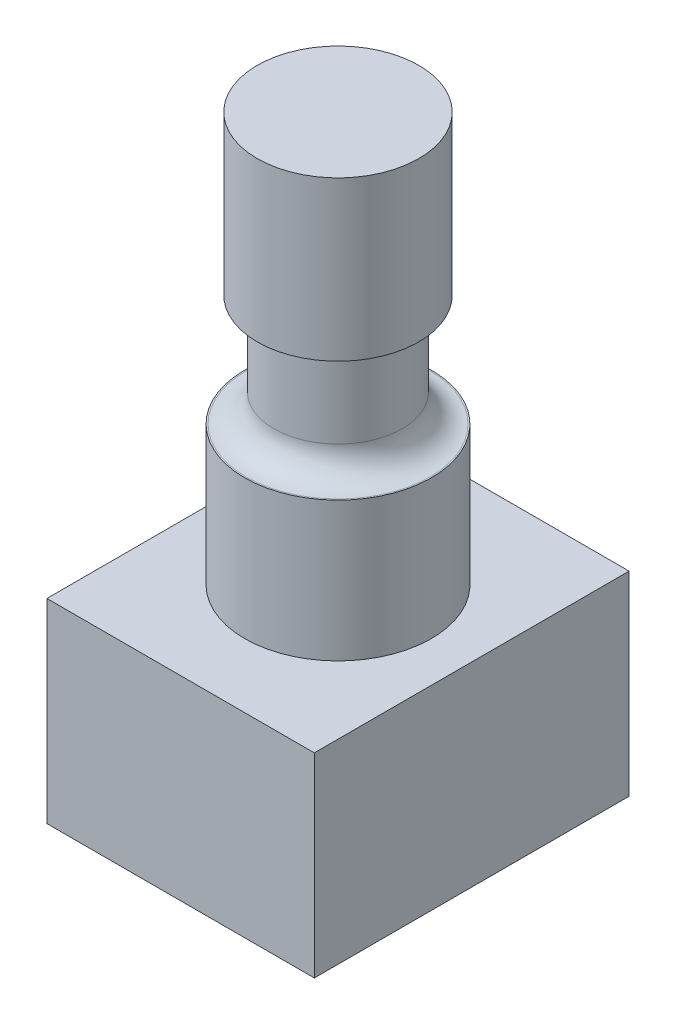
ISO-10303-21;
HEADER;
FILE_DESCRIPTION(('STEP AP214'),'2;1');
FILE_NAME('part.step','',(''),(''),'','','');
FILE_SCHEMA(('AUTOMOTIVE_DESIGN { 1 0 10303 214 1 1 1 1 }'));
ENDSEC;
DATA;
#1=APPLICATION_CONTEXT('core data for automotive mechanical design processes');
#2=APPLICATION_PROTOCOL_DEFINITION('international standard','automotive_design',2000,#1);
#3=PRODUCT_CONTEXT('',#1,'mechanical');
#4=PRODUCT('Part','Part','',(#3));
#5=PRODUCT_RELATED_PRODUCT_CATEGORY('part','',(#4));
#6=PRODUCT_DEFINITION_FORMATION('','',#4);
#7=PRODUCT_DEFINITION_CONTEXT('part definition',#1,'design');
#8=PRODUCT_DEFINITION('design','',#6,#7);
#9=PRODUCT_DEFINITION_SHAPE('','',#8);
#10=(LENGTH_UNIT() NAMED_UNIT(*) SI_UNIT(.MILLI.,.METRE.));
#11=(NAMED_UNIT(*) PLANE_ANGLE_UNIT() SI_UNIT($,.RADIAN.));
#12=(NAMED_UNIT(*) SI_UNIT($,.STERADIAN.) SOLID_ANGLE_UNIT());
#13=UNCERTAINTY_MEASURE_WITH_UNIT(LENGTH_MEASURE(1.E-05),#10,'distance_accuracy_value','');
#14=(GEOMETRIC_REPRESENTATION_CONTEXT(3) GLOBAL_UNCERTAINTY_ASSIGNED_CONTEXT((#13)) GLOBAL_UNIT_ASSIGNED_CONTEXT((#10,
#11,#12)) REPRESENTATION_CONTEXT('',''));
#15=CARTESIAN_POINT('',(0.,0.,0.));
#16=DIRECTION('',(0.,0.,1.));
#17=DIRECTION('',(1.,0.,0.));
#18=AXIS2_PLACEMENT_3D('',#15,#16,#17);
#19=CARTESIAN_POINT('',(-4.8,7.,5.65));
#20=DIRECTION('',(1.,0.,0.));
#21=DIRECTION('',(0.,0.,-1.));
#22=AXIS2_PLACEMENT_3D('',#19,#20,#21);
#23=PLANE('',#22);
#24=DIRECTION('',(0.,0.,1.));
#25=VECTOR('',#24,1.);
#26=CARTESIAN_POINT('',(-4.8,0.,5.65));
#27=LINE('',#26,#25);
#28=CARTESIAN_POINT('',(-4.8,0.,-5.65));
#29=VERTEX_POINT('',#28);
#30=CARTESIAN_POINT('',(-4.8,0.,5.65));
#31=VERTEX_POINT('',#30);
#32=EDGE_CURVE('E103',#29,#31,#27,.T.);
#33=ORIENTED_EDGE('',*,*,#32,.T.);
#34=DIRECTION('',(0.,-1.,0.));
#35=VECTOR('',#34,1.);
#36=CARTESIAN_POINT('',(-4.8,7.,5.65));
#37=LINE('',#36,#35);
#38=CARTESIAN_POINT('',(-4.8,7.,5.65));
#39=VERTEX_POINT('',#38);
#40=EDGE_CURVE('E94',#39,#31,#37,.T.);
#41=ORIENTED_EDGE('',*,*,#40,.F.);
#42=DIRECTION('',(0.,0.,1.));
#43=VECTOR('',#42,1.);
#44=CARTESIAN_POINT('',(-4.8,7.,5.65));
#45=LINE('',#44,#43);
#46=CARTESIAN_POINT('',(-4.8,7.,-5.65));
#47=VERTEX_POINT('',#46);
#48=EDGE_CURVE('E88',#47,#39,#45,.T.);
#49=ORIENTED_EDGE('',*,*,#48,.F.);
#50=DIRECTION('',(0.,-1.,0.));
#51=VECTOR('',#50,1.);
#52=CARTESIAN_POINT('',(-4.8,7.,-5.65));
#53=LINE('',#52,#51);
#54=EDGE_CURVE('E99',#47,#29,#53,.T.);
#55=ORIENTED_EDGE('',*,*,#54,.T.);
#56=EDGE_LOOP('',(#33,#41,#49,#55));
#57=FACE_BOUND('',#56,.T.);
#58=ADVANCED_FACE('F35',(#57),#23,.F.);
#59=CARTESIAN_POINT('',(4.8,7.,5.65));
#60=DIRECTION('',(0.,0.,-1.));
#61=DIRECTION('',(-1.,0.,0.));
#62=AXIS2_PLACEMENT_3D('',#59,#60,#61);
#63=PLANE('',#62);
#64=DIRECTION('',(1.,0.,0.));
#65=VECTOR('',#64,1.);
#66=CARTESIAN_POINT('',(4.8,0.,5.65));
#67=LINE('',#66,#65);
#68=CARTESIAN_POINT('',(4.8,0.,5.65));
#69=VERTEX_POINT('',#68);
#70=EDGE_CURVE('E93',#31,#69,#67,.T.);
#71=ORIENTED_EDGE('',*,*,#70,.T.);
#72=DIRECTION('',(0.,-1.,0.));
#73=VECTOR('',#72,1.);
#74=CARTESIAN_POINT('',(4.8,7.,5.65));
#75=LINE('',#74,#73);
#76=CARTESIAN_POINT('',(4.8,7.,5.65));
#77=VERTEX_POINT('',#76);
#78=EDGE_CURVE('E91',#77,#69,#75,.T.);
#79=ORIENTED_EDGE('',*,*,#78,.F.);
#80=DIRECTION('',(1.,0.,0.));
#81=VECTOR('',#80,1.);
#82=CARTESIAN_POINT('',(4.8,7.,5.65));
#83=LINE('',#82,#81);
#84=EDGE_CURVE('E83',#39,#77,#83,.T.);
#85=ORIENTED_EDGE('',*,*,#84,.F.);
#86=ORIENTED_EDGE('',*,*,#40,.T.);
#87=EDGE_LOOP('',(#71,#79,#85,#86));
#88=FACE_BOUND('',#87,.T.);
#89=ADVANCED_FACE('F92',(#88),#63,.F.);
#90=CARTESIAN_POINT('',(4.8,7.,5.65));
#91=DIRECTION('',(-1.,0.,0.));
#92=DIRECTION('',(0.,0.,1.));
#93=AXIS2_PLACEMENT_3D('',#90,#91,#92);
#94=PLANE('',#93);
#95=DIRECTION('',(0.,0.,-1.));
#96=VECTOR('',#95,1.);
#97=CARTESIAN_POINT('',(4.8,0.,5.65));
#98=LINE('',#97,#96);
#99=CARTESIAN_POINT('',(4.8,0.,-5.65));
#100=VERTEX_POINT('',#99);
#101=EDGE_CURVE('E69',#69,#100,#98,.T.);
#102=ORIENTED_EDGE('',*,*,#101,.T.);
#103=DIRECTION('',(0.,-1.,0.));
#104=VECTOR('',#103,1.);
#105=CARTESIAN_POINT('',(4.8,7.,-5.65));
#106=LINE('',#105,#104);
#107=CARTESIAN_POINT('',(4.8,7.,-5.65));
#108=VERTEX_POINT('',#107);
#109=EDGE_CURVE('E95',#108,#100,#106,.T.);
#110=ORIENTED_EDGE('',*,*,#109,.F.);
#111=DIRECTION('',(0.,0.,-1.));
#112=VECTOR('',#111,1.);
#113=CARTESIAN_POINT('',(4.8,7.,5.65));
#114=LINE('',#113,#112);
#115=EDGE_CURVE('E86',#77,#108,#114,.T.);
#116=ORIENTED_EDGE('',*,*,#115,.F.);
#117=ORIENTED_EDGE('',*,*,#78,.T.);
#118=EDGE_LOOP('',(#102,#110,#116,#117));
#119=FACE_BOUND('',#118,.T.);
#120=ADVANCED_FACE('F97',(#119),#94,.F.);
#121=CARTESIAN_POINT('',(4.8,7.,-5.65));
#122=DIRECTION('',(0.,0.,1.));
#123=DIRECTION('',(1.,0.,0.));
#124=AXIS2_PLACEMENT_3D('',#121,#122,#123);
#125=PLANE('',#124);
#126=DIRECTION('',(-1.,0.,0.));
#127=VECTOR('',#126,1.);
#128=CARTESIAN_POINT('',(4.8,0.,-5.65));
#129=LINE('',#128,#127);
#130=EDGE_CURVE('E75',#100,#29,#129,.T.);
#131=ORIENTED_EDGE('',*,*,#130,.T.);
#132=ORIENTED_EDGE('',*,*,#54,.F.);
#133=DIRECTION('',(-1.,0.,0.));
#134=VECTOR('',#133,1.);
#135=CARTESIAN_POINT('',(4.8,7.,-5.65));
#136=LINE('',#135,#134);
#137=EDGE_CURVE('E52',#108,#47,#136,.T.);
#138=ORIENTED_EDGE('',*,*,#137,.F.);
#139=ORIENTED_EDGE('',*,*,#109,.T.);
#140=EDGE_LOOP('',(#131,#132,#138,#139));
#141=FACE_BOUND('',#140,.T.);
#142=ADVANCED_FACE('F140',(#141),#125,.F.);
#143=CARTESIAN_POINT('',(0.,7.,0.));
#144=DIRECTION('',(0.,1.,0.));
#145=DIRECTION('',(0.,0.,1.));
#146=AXIS2_PLACEMENT_3D('',#143,#144,#145);
#147=PLANE('',#146);
#148=CARTESIAN_POINT('',(0.,7.,0.));
#149=DIRECTION('',(0.,1.,0.));
#150=DIRECTION('',(0.,0.,1.));
#151=AXIS2_PLACEMENT_3D('',#148,#149,#150);
#152=CIRCLE('',#151,3.35);
#153=CARTESIAN_POINT('',(0.,7.,3.35));
#154=VERTEX_POINT('',#153);
#155=EDGE_CURVE('E172',#154,#154,#152,.T.);
#156=ORIENTED_EDGE('',*,*,#155,.F.);
#157=EDGE_LOOP('',(#156));
#158=FACE_BOUND('',#157,.T.);
#159=ORIENTED_EDGE('',*,*,#48,.T.);
#160=ORIENTED_EDGE('',*,*,#84,.T.);
#161=ORIENTED_EDGE('',*,*,#115,.T.);
#162=ORIENTED_EDGE('',*,*,#137,.T.);
#163=EDGE_LOOP('',(#159,#160,#161,#162));
#164=FACE_BOUND('',#163,.T.);
#165=ADVANCED_FACE('F84',(#158,#164),#147,.T.);
#166=CARTESIAN_POINT('',(0.,0.,0.));
#167=DIRECTION('',(0.,1.,0.));
#168=DIRECTION('',(0.,0.,1.));
#169=AXIS2_PLACEMENT_3D('',#166,#167,#168);
#170=PLANE('',#169);
#171=ORIENTED_EDGE('',*,*,#32,.F.);
#172=ORIENTED_EDGE('',*,*,#130,.F.);
#173=ORIENTED_EDGE('',*,*,#101,.F.);
#174=ORIENTED_EDGE('',*,*,#70,.F.);
#175=EDGE_LOOP('',(#171,#172,#173,#174));
#176=FACE_BOUND('',#175,.T.);
#177=ADVANCED_FACE('F143',(#176),#170,.F.);
#178=CARTESIAN_POINT('',(0.,12.,0.));
#179=DIRECTION('',(0.,-1.,0.));
#180=DIRECTION('',(0.,0.,-1.));
#181=AXIS2_PLACEMENT_3D('',#178,#179,#180);
#182=CYLINDRICAL_SURFACE('',#181,3.35);
#183=CARTESIAN_POINT('',(0.,12.,0.));
#184=DIRECTION('',(0.,1.,0.));
#185=DIRECTION('',(0.,0.,1.));
#186=AXIS2_PLACEMENT_3D('',#183,#184,#185);
#187=CIRCLE('',#186,3.35);
#188=CARTESIAN_POINT('',(0.,12.,3.35));
#189=VERTEX_POINT('',#188);
#190=EDGE_CURVE('E106',#189,#189,#187,.T.);
#191=ORIENTED_EDGE('',*,*,#190,.F.);
#192=EDGE_LOOP('',(#191));
#193=FACE_BOUND('',#192,.T.);
#194=ORIENTED_EDGE('',*,*,#155,.T.);
#195=EDGE_LOOP('',(#194));
#196=FACE_BOUND('',#195,.T.);
#197=ADVANCED_FACE('F146',(#193,#196),#182,.T.);
#198=CARTESIAN_POINT('',(0.,12.,0.));
#199=DIRECTION('',(0.,1.,0.));
#200=DIRECTION('',(0.,0.,1.));
#201=AXIS2_PLACEMENT_3D('',#198,#199,#200);
#202=PLANE('',#201);
#203=CARTESIAN_POINT('',(0.,12.,0.));
#204=DIRECTION('',(0.,1.,0.));
#205=DIRECTION('',(0.,0.,1.));
#206=AXIS2_PLACEMENT_3D('',#203,#204,#205);
#207=CIRCLE('',#206,3.3);
#208=CARTESIAN_POINT('',(0.,12.,3.3));
#209=VERTEX_POINT('',#208);
#210=EDGE_CURVE('E11',#209,#209,#207,.F.);
#211=ORIENTED_EDGE('',*,*,#210,.T.);
#212=EDGE_LOOP('',(#211));
#213=FACE_BOUND('',#212,.T.);
#214=ORIENTED_EDGE('',*,*,#190,.T.);
#215=EDGE_LOOP('',(#214));
#216=FACE_BOUND('',#215,.T.);
#217=ADVANCED_FACE('F128',(#213,#216),#202,.T.);
#218=CARTESIAN_POINT('',(0.,16.,0.));
#219=DIRECTION('',(0.,-1.,0.));
#220=DIRECTION('',(0.,0.,-1.));
#221=AXIS2_PLACEMENT_3D('',#218,#219,#220);
#222=CYLINDRICAL_SURFACE('',#221,2.3);
#223=CARTESIAN_POINT('',(0.,13.,0.));
#224=DIRECTION('',(0.,1.,0.));
#225=DIRECTION('',(0.,0.,1.));
#226=AXIS2_PLACEMENT_3D('',#223,#224,#225);
#227=CIRCLE('',#226,2.3);
#228=CARTESIAN_POINT('',(0.,13.,2.3));
#229=VERTEX_POINT('',#228);
#230=EDGE_CURVE('E44',#229,#229,#227,.T.);
#231=ORIENTED_EDGE('',*,*,#230,.T.);
#232=EDGE_LOOP('',(#231));
#233=FACE_BOUND('',#232,.T.);
#234=CARTESIAN_POINT('',(0.,16.,0.));
#235=DIRECTION('',(0.,1.,0.));
#236=DIRECTION('',(0.,0.,1.));
#237=AXIS2_PLACEMENT_3D('',#234,#235,#236);
#238=CIRCLE('',#237,2.3);
#239=CARTESIAN_POINT('',(0.,16.,2.3));
#240=VERTEX_POINT('',#239);
#241=EDGE_CURVE('E168',#240,#240,#238,.T.);
#242=ORIENTED_EDGE('',*,*,#241,.F.);
#243=EDGE_LOOP('',(#242));
#244=FACE_BOUND('',#243,.T.);
#245=ADVANCED_FACE('F115',(#233,#244),#222,.T.);
#246=CARTESIAN_POINT('',(0.,13.,0.));
#247=DIRECTION('',(0.,1.,0.));
#248=DIRECTION('',(0.,0.,1.));
#249=AXIS2_PLACEMENT_3D('',#246,#247,#248);
#250=TOROIDAL_SURFACE('',#249,3.3,1.);
#251=ORIENTED_EDGE('',*,*,#210,.F.);
#252=EDGE_LOOP('',(#251));
#253=FACE_BOUND('',#252,.T.);
#254=ORIENTED_EDGE('',*,*,#230,.F.);
#255=EDGE_LOOP('',(#254));
#256=FACE_BOUND('',#255,.T.);
#257=ADVANCED_FACE('F37',(#253,#256),#250,.F.);
#258=CARTESIAN_POINT('',(0.,21.7,0.));
#259=DIRECTION('',(0.,-1.,0.));
#260=DIRECTION('',(0.,0.,-1.));
#261=AXIS2_PLACEMENT_3D('',#258,#259,#260);
#262=CYLINDRICAL_SURFACE('',#261,2.9);
#263=CARTESIAN_POINT('',(0.,21.7,0.));
#264=DIRECTION('',(0.,1.,0.));
#265=DIRECTION('',(0.,0.,1.));
#266=AXIS2_PLACEMENT_3D('',#263,#264,#265);
#267=CIRCLE('',#266,2.9);
#268=CARTESIAN_POINT('',(0.,21.7,2.9));
#269=VERTEX_POINT('',#268);
#270=EDGE_CURVE('E167',#269,#269,#267,.T.);
#271=ORIENTED_EDGE('',*,*,#270,.F.);
#272=EDGE_LOOP('',(#271));
#273=FACE_BOUND('',#272,.T.);
#274=CARTESIAN_POINT('',(0.,16.,0.));
#275=DIRECTION('',(0.,1.,0.));
#276=DIRECTION('',(0.,0.,1.));
#277=AXIS2_PLACEMENT_3D('',#274,#275,#276);
#278=CIRCLE('',#277,2.9);
#279=CARTESIAN_POINT('',(0.,16.,2.9));
#280=VERTEX_POINT('',#279);
#281=EDGE_CURVE('E169',#280,#280,#278,.T.);
#282=ORIENTED_EDGE('',*,*,#281,.T.);
#283=EDGE_LOOP('',(#282));
#284=FACE_BOUND('',#283,.T.);
#285=ADVANCED_FACE('F119',(#273,#284),#262,.T.);
#286=CARTESIAN_POINT('',(0.,21.7,0.));
#287=DIRECTION('',(0.,1.,0.));
#288=DIRECTION('',(0.,0.,1.));
#289=AXIS2_PLACEMENT_3D('',#286,#287,#288);
#290=PLANE('',#289);
#291=ORIENTED_EDGE('',*,*,#270,.T.);
#292=EDGE_LOOP('',(#291));
#293=FACE_BOUND('',#292,.T.);
#294=ADVANCED_FACE('F125',(#293),#290,.T.);
#295=CARTESIAN_POINT('',(0.,16.,0.));
#296=DIRECTION('',(0.,1.,0.));
#297=DIRECTION('',(0.,0.,1.));
#298=AXIS2_PLACEMENT_3D('',#295,#296,#297);
#299=PLANE('',#298);
#300=ORIENTED_EDGE('',*,*,#241,.T.);
#301=EDGE_LOOP('',(#300));
#302=FACE_BOUND('',#301,.T.);
#303=ORIENTED_EDGE('',*,*,#281,.F.);
#304=EDGE_LOOP('',(#303));
#305=FACE_BOUND('',#304,.T.);
#306=ADVANCED_FACE('F157',(#302,#305),#299,.F.);
#307=CLOSED_SHELL('',(#58,#89,#120,#142,#165,#177,#197,#217,#245,#257,#285,#294,#306));
#308=MANIFOLD_SOLID_BREP('B2',#307);
#309=ADVANCED_BREP_SHAPE_REPRESENTATION('',(#18,#308),#14);
#310=SHAPE_DEFINITION_REPRESENTATION(#9,#309);
ENDSEC;
END-ISO-10303-21;
